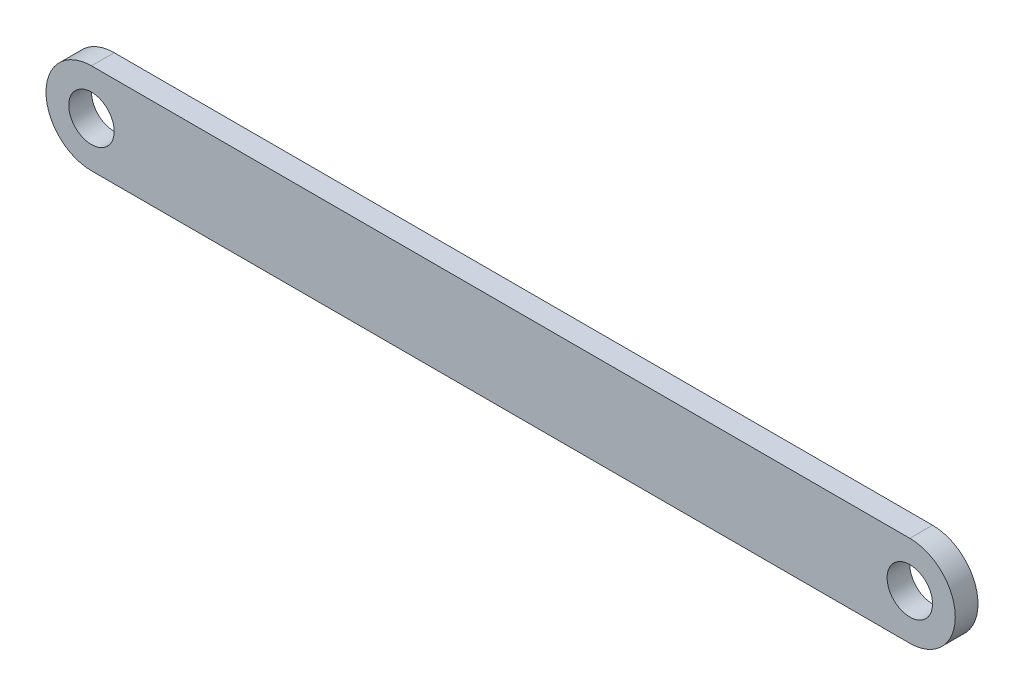
ISO-10303-21;
HEADER;
FILE_DESCRIPTION(('STEP AP214'),'2;1');
FILE_NAME('part.step','',(''),(''),'','','');
FILE_SCHEMA(('AUTOMOTIVE_DESIGN { 1 0 10303 214 1 1 1 1 }'));
ENDSEC;
DATA;
#1=APPLICATION_CONTEXT('core data for automotive mechanical design processes');
#2=APPLICATION_PROTOCOL_DEFINITION('international standard','automotive_design',2000,#1);
#3=PRODUCT_CONTEXT('',#1,'mechanical');
#4=PRODUCT('Part','Part','',(#3));
#5=PRODUCT_RELATED_PRODUCT_CATEGORY('part','',(#4));
#6=PRODUCT_DEFINITION_FORMATION('','',#4);
#7=PRODUCT_DEFINITION_CONTEXT('part definition',#1,'design');
#8=PRODUCT_DEFINITION('design','',#6,#7);
#9=PRODUCT_DEFINITION_SHAPE('','',#8);
#10=(LENGTH_UNIT() NAMED_UNIT(*) SI_UNIT(.MILLI.,.METRE.));
#11=(NAMED_UNIT(*) PLANE_ANGLE_UNIT() SI_UNIT($,.RADIAN.));
#12=(NAMED_UNIT(*) SI_UNIT($,.STERADIAN.) SOLID_ANGLE_UNIT());
#13=UNCERTAINTY_MEASURE_WITH_UNIT(LENGTH_MEASURE(1.E-05),#10,'distance_accuracy_value','');
#14=(GEOMETRIC_REPRESENTATION_CONTEXT(3) GLOBAL_UNCERTAINTY_ASSIGNED_CONTEXT((#13)) GLOBAL_UNIT_ASSIGNED_CONTEXT((#10,
#11,#12)) REPRESENTATION_CONTEXT('',''));
#15=CARTESIAN_POINT('',(0.,0.,0.));
#16=DIRECTION('',(0.,0.,1.));
#17=DIRECTION('',(1.,0.,0.));
#18=AXIS2_PLACEMENT_3D('',#15,#16,#17);
#19=CARTESIAN_POINT('',(-57.15,0.,3.175));
#20=DIRECTION('',(0.,0.,1.));
#21=DIRECTION('',(1.,0.,0.));
#22=AXIS2_PLACEMENT_3D('',#19,#20,#21);
#23=PLANE('',#22);
#24=CARTESIAN_POINT('',(-57.15,0.,3.175));
#25=DIRECTION('',(0.,0.,1.));
#26=DIRECTION('',(1.,0.,0.));
#27=AXIS2_PLACEMENT_3D('',#24,#25,#26);
#28=CIRCLE('',#27,3.175);
#29=CARTESIAN_POINT('',(-53.975,0.,3.175));
#30=VERTEX_POINT('',#29);
#31=EDGE_CURVE('E129',#30,#30,#28,.T.);
#32=ORIENTED_EDGE('',*,*,#31,.F.);
#33=EDGE_LOOP('',(#32));
#34=FACE_BOUND('',#33,.T.);
#35=CARTESIAN_POINT('',(-57.15,0.,3.175));
#36=DIRECTION('',(0.,0.,1.));
#37=DIRECTION('',(1.,0.,0.));
#38=AXIS2_PLACEMENT_3D('',#35,#36,#37);
#39=CIRCLE('',#38,6.35);
#40=CARTESIAN_POINT('',(-57.15,6.35,3.175));
#41=VERTEX_POINT('',#40);
#42=CARTESIAN_POINT('',(-57.15,-6.35,3.175));
#43=VERTEX_POINT('',#42);
#44=EDGE_CURVE('E113',#41,#43,#39,.T.);
#45=ORIENTED_EDGE('',*,*,#44,.T.);
#46=DIRECTION('',(1.,0.,0.));
#47=VECTOR('',#46,1.);
#48=CARTESIAN_POINT('',(-57.15,-6.35,3.175));
#49=LINE('',#48,#47);
#50=CARTESIAN_POINT('',(57.15,-6.35,3.175));
#51=VERTEX_POINT('',#50);
#52=EDGE_CURVE('E106',#43,#51,#49,.T.);
#53=ORIENTED_EDGE('',*,*,#52,.T.);
#54=CARTESIAN_POINT('',(57.15,0.,3.175));
#55=DIRECTION('',(0.,0.,1.));
#56=DIRECTION('',(1.,0.,0.));
#57=AXIS2_PLACEMENT_3D('',#54,#55,#56);
#58=CIRCLE('',#57,6.35);
#59=CARTESIAN_POINT('',(57.15,6.35,3.175));
#60=VERTEX_POINT('',#59);
#61=EDGE_CURVE('E112',#51,#60,#58,.T.);
#62=ORIENTED_EDGE('',*,*,#61,.T.);
#63=DIRECTION('',(1.,0.,0.));
#64=VECTOR('',#63,1.);
#65=CARTESIAN_POINT('',(-57.15,6.35,3.175));
#66=LINE('',#65,#64);
#67=EDGE_CURVE('E122',#41,#60,#66,.T.);
#68=ORIENTED_EDGE('',*,*,#67,.F.);
#69=EDGE_LOOP('',(#45,#53,#62,#68));
#70=FACE_BOUND('',#69,.T.);
#71=CARTESIAN_POINT('',(57.15,0.,3.175));
#72=DIRECTION('',(0.,0.,1.));
#73=DIRECTION('',(1.,0.,0.));
#74=AXIS2_PLACEMENT_3D('',#71,#72,#73);
#75=CIRCLE('',#74,3.175);
#76=CARTESIAN_POINT('',(60.325,0.,3.175));
#77=VERTEX_POINT('',#76);
#78=EDGE_CURVE('E142',#77,#77,#75,.T.);
#79=ORIENTED_EDGE('',*,*,#78,.F.);
#80=EDGE_LOOP('',(#79));
#81=FACE_BOUND('',#80,.T.);
#82=ADVANCED_FACE('F63',(#34,#70,#81),#23,.T.);
#83=CARTESIAN_POINT('',(-57.15,0.,0.));
#84=DIRECTION('',(0.,0.,1.));
#85=DIRECTION('',(1.,0.,0.));
#86=AXIS2_PLACEMENT_3D('',#83,#84,#85);
#87=PLANE('',#86);
#88=CARTESIAN_POINT('',(-57.15,0.,0.));
#89=DIRECTION('',(0.,0.,1.));
#90=DIRECTION('',(1.,0.,0.));
#91=AXIS2_PLACEMENT_3D('',#88,#89,#90);
#92=CIRCLE('',#91,6.35);
#93=CARTESIAN_POINT('',(-57.15,6.35,0.));
#94=VERTEX_POINT('',#93);
#95=CARTESIAN_POINT('',(-57.15,-6.35,0.));
#96=VERTEX_POINT('',#95);
#97=EDGE_CURVE('E127',#94,#96,#92,.T.);
#98=ORIENTED_EDGE('',*,*,#97,.F.);
#99=DIRECTION('',(1.,0.,0.));
#100=VECTOR('',#99,1.);
#101=CARTESIAN_POINT('',(-57.15,6.35,0.));
#102=LINE('',#101,#100);
#103=CARTESIAN_POINT('',(57.15,6.35,0.));
#104=VERTEX_POINT('',#103);
#105=EDGE_CURVE('E133',#94,#104,#102,.T.);
#106=ORIENTED_EDGE('',*,*,#105,.T.);
#107=CARTESIAN_POINT('',(57.15,0.,0.));
#108=DIRECTION('',(0.,0.,1.));
#109=DIRECTION('',(1.,0.,0.));
#110=AXIS2_PLACEMENT_3D('',#107,#108,#109);
#111=CIRCLE('',#110,6.35);
#112=CARTESIAN_POINT('',(57.15,-6.35,0.));
#113=VERTEX_POINT('',#112);
#114=EDGE_CURVE('E131',#113,#104,#111,.T.);
#115=ORIENTED_EDGE('',*,*,#114,.F.);
#116=DIRECTION('',(1.,0.,0.));
#117=VECTOR('',#116,1.);
#118=CARTESIAN_POINT('',(-57.15,-6.35,0.));
#119=LINE('',#118,#117);
#120=EDGE_CURVE('E118',#96,#113,#119,.T.);
#121=ORIENTED_EDGE('',*,*,#120,.F.);
#122=EDGE_LOOP('',(#98,#106,#115,#121));
#123=FACE_BOUND('',#122,.T.);
#124=CARTESIAN_POINT('',(-57.15,0.,0.));
#125=DIRECTION('',(0.,0.,1.));
#126=DIRECTION('',(1.,0.,0.));
#127=AXIS2_PLACEMENT_3D('',#124,#125,#126);
#128=CIRCLE('',#127,3.175);
#129=CARTESIAN_POINT('',(-53.975,0.,0.));
#130=VERTEX_POINT('',#129);
#131=EDGE_CURVE('E139',#130,#130,#128,.T.);
#132=ORIENTED_EDGE('',*,*,#131,.T.);
#133=EDGE_LOOP('',(#132));
#134=FACE_BOUND('',#133,.T.);
#135=CARTESIAN_POINT('',(57.15,0.,0.));
#136=DIRECTION('',(0.,0.,1.));
#137=DIRECTION('',(1.,0.,0.));
#138=AXIS2_PLACEMENT_3D('',#135,#136,#137);
#139=CIRCLE('',#138,3.175);
#140=CARTESIAN_POINT('',(60.325,0.,0.));
#141=VERTEX_POINT('',#140);
#142=EDGE_CURVE('E145',#141,#141,#139,.T.);
#143=ORIENTED_EDGE('',*,*,#142,.T.);
#144=EDGE_LOOP('',(#143));
#145=FACE_BOUND('',#144,.T.);
#146=ADVANCED_FACE('F154',(#123,#134,#145),#87,.F.);
#147=CARTESIAN_POINT('',(-57.15,0.,3.175));
#148=DIRECTION('',(0.,0.,-1.));
#149=DIRECTION('',(-1.,0.,0.));
#150=AXIS2_PLACEMENT_3D('',#147,#148,#149);
#151=CYLINDRICAL_SURFACE('',#150,6.35);
#152=ORIENTED_EDGE('',*,*,#97,.T.);
#153=DIRECTION('',(0.,0.,-1.));
#154=VECTOR('',#153,1.);
#155=CARTESIAN_POINT('',(-57.15,-6.35,3.175));
#156=LINE('',#155,#154);
#157=EDGE_CURVE('E12',#43,#96,#156,.T.);
#158=ORIENTED_EDGE('',*,*,#157,.F.);
#159=ORIENTED_EDGE('',*,*,#44,.F.);
#160=DIRECTION('',(0.,0.,-1.));
#161=VECTOR('',#160,1.);
#162=CARTESIAN_POINT('',(-57.15,6.35,3.175));
#163=LINE('',#162,#161);
#164=EDGE_CURVE('E80',#41,#94,#163,.T.);
#165=ORIENTED_EDGE('',*,*,#164,.T.);
#166=EDGE_LOOP('',(#152,#158,#159,#165));
#167=FACE_BOUND('',#166,.T.);
#168=ADVANCED_FACE('F65',(#167),#151,.T.);
#169=CARTESIAN_POINT('',(-57.15,-6.35,3.175));
#170=DIRECTION('',(0.,1.,0.));
#171=DIRECTION('',(0.,0.,1.));
#172=AXIS2_PLACEMENT_3D('',#169,#170,#171);
#173=PLANE('',#172);
#174=ORIENTED_EDGE('',*,*,#120,.T.);
#175=DIRECTION('',(0.,0.,-1.));
#176=VECTOR('',#175,1.);
#177=CARTESIAN_POINT('',(57.15,-6.35,3.175));
#178=LINE('',#177,#176);
#179=EDGE_CURVE('E72',#51,#113,#178,.T.);
#180=ORIENTED_EDGE('',*,*,#179,.F.);
#181=ORIENTED_EDGE('',*,*,#52,.F.);
#182=ORIENTED_EDGE('',*,*,#157,.T.);
#183=EDGE_LOOP('',(#174,#180,#181,#182));
#184=FACE_BOUND('',#183,.T.);
#185=ADVANCED_FACE('F117',(#184),#173,.F.);
#186=CARTESIAN_POINT('',(57.15,0.,3.175));
#187=DIRECTION('',(0.,0.,-1.));
#188=DIRECTION('',(-1.,0.,0.));
#189=AXIS2_PLACEMENT_3D('',#186,#187,#188);
#190=CYLINDRICAL_SURFACE('',#189,6.35);
#191=ORIENTED_EDGE('',*,*,#114,.T.);
#192=DIRECTION('',(0.,0.,-1.));
#193=VECTOR('',#192,1.);
#194=CARTESIAN_POINT('',(57.15,6.35,3.175));
#195=LINE('',#194,#193);
#196=EDGE_CURVE('E95',#60,#104,#195,.T.);
#197=ORIENTED_EDGE('',*,*,#196,.F.);
#198=ORIENTED_EDGE('',*,*,#61,.F.);
#199=ORIENTED_EDGE('',*,*,#179,.T.);
#200=EDGE_LOOP('',(#191,#197,#198,#199));
#201=FACE_BOUND('',#200,.T.);
#202=ADVANCED_FACE('F121',(#201),#190,.T.);
#203=CARTESIAN_POINT('',(-57.15,6.35,3.175));
#204=DIRECTION('',(0.,1.,0.));
#205=DIRECTION('',(0.,0.,1.));
#206=AXIS2_PLACEMENT_3D('',#203,#204,#205);
#207=PLANE('',#206);
#208=ORIENTED_EDGE('',*,*,#105,.F.);
#209=ORIENTED_EDGE('',*,*,#164,.F.);
#210=ORIENTED_EDGE('',*,*,#67,.T.);
#211=ORIENTED_EDGE('',*,*,#196,.T.);
#212=EDGE_LOOP('',(#208,#209,#210,#211));
#213=FACE_BOUND('',#212,.T.);
#214=ADVANCED_FACE('F166',(#213),#207,.T.);
#215=CARTESIAN_POINT('',(-57.15,0.,3.175));
#216=DIRECTION('',(0.,0.,-1.));
#217=DIRECTION('',(-1.,0.,0.));
#218=AXIS2_PLACEMENT_3D('',#215,#216,#217);
#219=CYLINDRICAL_SURFACE('',#218,3.175);
#220=ORIENTED_EDGE('',*,*,#31,.T.);
#221=EDGE_LOOP('',(#220));
#222=FACE_BOUND('',#221,.T.);
#223=ORIENTED_EDGE('',*,*,#131,.F.);
#224=EDGE_LOOP('',(#223));
#225=FACE_BOUND('',#224,.T.);
#226=ADVANCED_FACE('F163',(#222,#225),#219,.F.);
#227=CARTESIAN_POINT('',(57.15,0.,3.175));
#228=DIRECTION('',(0.,0.,-1.));
#229=DIRECTION('',(-1.,0.,0.));
#230=AXIS2_PLACEMENT_3D('',#227,#228,#229);
#231=CYLINDRICAL_SURFACE('',#230,3.175);
#232=ORIENTED_EDGE('',*,*,#78,.T.);
#233=EDGE_LOOP('',(#232));
#234=FACE_BOUND('',#233,.T.);
#235=ORIENTED_EDGE('',*,*,#142,.F.);
#236=EDGE_LOOP('',(#235));
#237=FACE_BOUND('',#236,.T.);
#238=ADVANCED_FACE('F151',(#234,#237),#231,.F.);
#239=CLOSED_SHELL('',(#82,#146,#168,#185,#202,#214,#226,#238));
#240=MANIFOLD_SOLID_BREP('B2',#239);
#241=ADVANCED_BREP_SHAPE_REPRESENTATION('',(#18,#240),#14);
#242=SHAPE_DEFINITION_REPRESENTATION(#9,#241);
ENDSEC;
END-ISO-10303-21;
